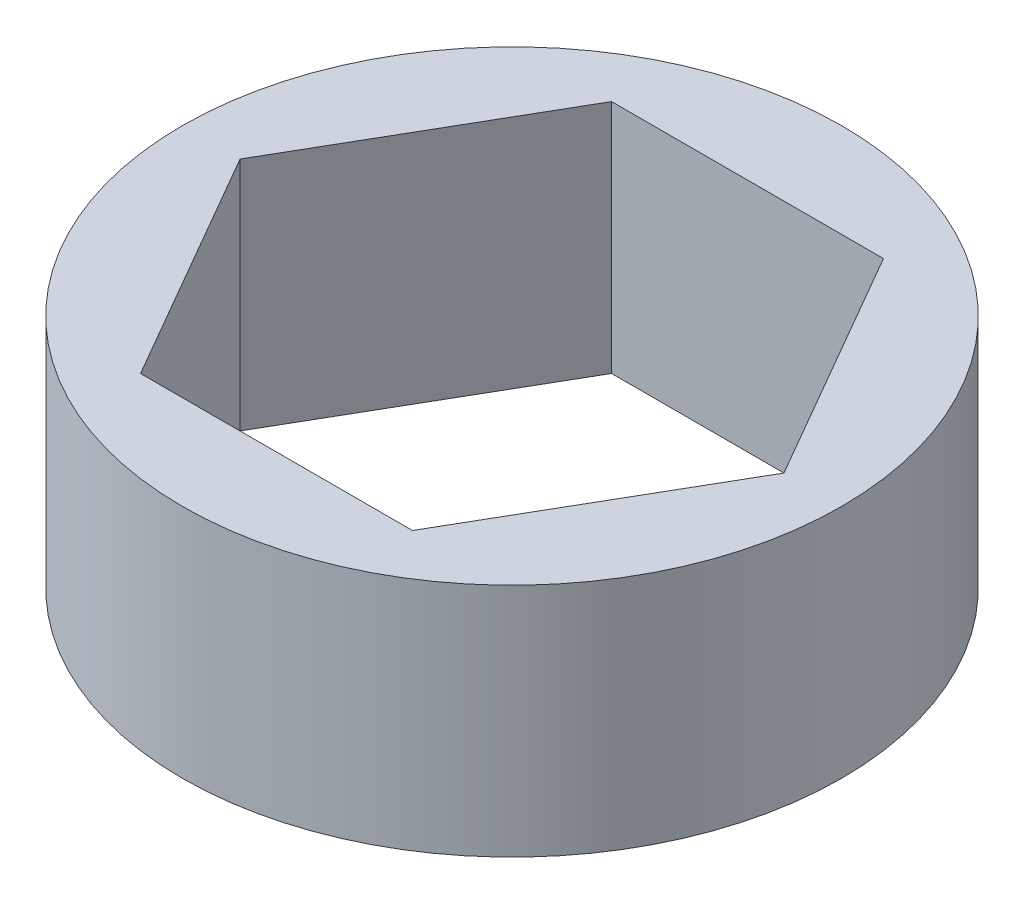
ISO-10303-21;
HEADER;
FILE_DESCRIPTION(('STEP AP214'),'2;1');
FILE_NAME('part.step','',(''),(''),'','','');
FILE_SCHEMA(('AUTOMOTIVE_DESIGN { 1 0 10303 214 1 1 1 1 }'));
ENDSEC;
DATA;
#1=APPLICATION_CONTEXT('core data for automotive mechanical design processes');
#2=APPLICATION_PROTOCOL_DEFINITION('international standard','automotive_design',2000,#1);
#3=PRODUCT_CONTEXT('',#1,'mechanical');
#4=PRODUCT('Part','Part','',(#3));
#5=PRODUCT_RELATED_PRODUCT_CATEGORY('part','',(#4));
#6=PRODUCT_DEFINITION_FORMATION('','',#4);
#7=PRODUCT_DEFINITION_CONTEXT('part definition',#1,'design');
#8=PRODUCT_DEFINITION('design','',#6,#7);
#9=PRODUCT_DEFINITION_SHAPE('','',#8);
#10=(LENGTH_UNIT() NAMED_UNIT(*) SI_UNIT(.MILLI.,.METRE.));
#11=(NAMED_UNIT(*) PLANE_ANGLE_UNIT() SI_UNIT($,.RADIAN.));
#12=(NAMED_UNIT(*) SI_UNIT($,.STERADIAN.) SOLID_ANGLE_UNIT());
#13=UNCERTAINTY_MEASURE_WITH_UNIT(LENGTH_MEASURE(1.E-05),#10,'distance_accuracy_value','');
#14=(GEOMETRIC_REPRESENTATION_CONTEXT(3) GLOBAL_UNCERTAINTY_ASSIGNED_CONTEXT((#13)) GLOBAL_UNIT_ASSIGNED_CONTEXT((#10,
#11,#12)) REPRESENTATION_CONTEXT('',''));
#15=CARTESIAN_POINT('',(0.,0.,0.));
#16=DIRECTION('',(0.,0.,1.));
#17=DIRECTION('',(1.,0.,0.));
#18=AXIS2_PLACEMENT_3D('',#15,#16,#17);
#19=CARTESIAN_POINT('',(0.,6.35,0.));
#20=DIRECTION('',(0.,1.,0.));
#21=DIRECTION('',(0.,0.,1.));
#22=AXIS2_PLACEMENT_3D('',#19,#20,#21);
#23=PLANE('',#22);
#24=CARTESIAN_POINT('',(0.,6.35,0.));
#25=DIRECTION('',(0.,1.,0.));
#26=DIRECTION('',(0.,0.,1.));
#27=AXIS2_PLACEMENT_3D('',#24,#25,#26);
#28=CIRCLE('',#27,8.89);
#29=CARTESIAN_POINT('',(0.,6.35,8.89));
#30=VERTEX_POINT('',#29);
#31=EDGE_CURVE('E11',#30,#30,#28,.T.);
#32=ORIENTED_EDGE('',*,*,#31,.T.);
#33=EDGE_LOOP('',(#32));
#34=FACE_BOUND('',#33,.T.);
#35=DIRECTION('',(-0.5,0.,-0.866025403784439));
#36=VECTOR('',#35,1.);
#37=CARTESIAN_POINT('',(7.33234841870825,6.35,0.));
#38=LINE('',#37,#36);
#39=CARTESIAN_POINT('',(7.33234841870825,6.35,0.));
#40=VERTEX_POINT('',#39);
#41=CARTESIAN_POINT('',(3.66617420935412,6.35,-6.35000000000001));
#42=VERTEX_POINT('',#41);
#43=EDGE_CURVE('E108',#40,#42,#38,.T.);
#44=ORIENTED_EDGE('',*,*,#43,.F.);
#45=DIRECTION('',(0.5,0.,-0.866025403784439));
#46=VECTOR('',#45,1.);
#47=CARTESIAN_POINT('',(3.66617420935413,6.35,6.35));
#48=LINE('',#47,#46);
#49=CARTESIAN_POINT('',(3.66617420935413,6.35,6.35));
#50=VERTEX_POINT('',#49);
#51=EDGE_CURVE('E99',#50,#40,#48,.T.);
#52=ORIENTED_EDGE('',*,*,#51,.F.);
#53=DIRECTION('',(1.,0.,0.));
#54=VECTOR('',#53,1.);
#55=CARTESIAN_POINT('',(-3.66617420935413,6.35,6.35));
#56=LINE('',#55,#54);
#57=CARTESIAN_POINT('',(-3.66617420935413,6.35,6.35));
#58=VERTEX_POINT('',#57);
#59=EDGE_CURVE('E133',#58,#50,#56,.T.);
#60=ORIENTED_EDGE('',*,*,#59,.F.);
#61=DIRECTION('',(0.5,0.,0.866025403784439));
#62=VECTOR('',#61,1.);
#63=CARTESIAN_POINT('',(-7.33234841870825,6.35,0.));
#64=LINE('',#63,#62);
#65=CARTESIAN_POINT('',(-7.33234841870825,6.35,0.));
#66=VERTEX_POINT('',#65);
#67=EDGE_CURVE('E130',#66,#58,#64,.T.);
#68=ORIENTED_EDGE('',*,*,#67,.F.);
#69=DIRECTION('',(-0.5,0.,0.866025403784439));
#70=VECTOR('',#69,1.);
#71=CARTESIAN_POINT('',(-3.66617420935413,6.35,-6.35000000000001));
#72=LINE('',#71,#70);
#73=CARTESIAN_POINT('',(-3.66617420935413,6.35,-6.35000000000001));
#74=VERTEX_POINT('',#73);
#75=EDGE_CURVE('E125',#74,#66,#72,.T.);
#76=ORIENTED_EDGE('',*,*,#75,.F.);
#77=DIRECTION('',(-1.,0.,0.));
#78=VECTOR('',#77,1.);
#79=CARTESIAN_POINT('',(3.66617420935412,6.35,-6.35000000000001));
#80=LINE('',#79,#78);
#81=EDGE_CURVE('E121',#42,#74,#80,.T.);
#82=ORIENTED_EDGE('',*,*,#81,.F.);
#83=EDGE_LOOP('',(#44,#52,#60,#68,#76,#82));
#84=FACE_BOUND('',#83,.T.);
#85=ADVANCED_FACE('F45',(#34,#84),#23,.T.);
#86=CARTESIAN_POINT('',(0.,0.,0.));
#87=DIRECTION('',(0.,1.,0.));
#88=DIRECTION('',(0.,0.,1.));
#89=AXIS2_PLACEMENT_3D('',#86,#87,#88);
#90=PLANE('',#89);
#91=CARTESIAN_POINT('',(0.,0.,0.));
#92=DIRECTION('',(0.,1.,0.));
#93=DIRECTION('',(0.,0.,1.));
#94=AXIS2_PLACEMENT_3D('',#91,#92,#93);
#95=CIRCLE('',#94,8.89);
#96=CARTESIAN_POINT('',(0.,0.,8.89));
#97=VERTEX_POINT('',#96);
#98=EDGE_CURVE('E49',#97,#97,#95,.T.);
#99=ORIENTED_EDGE('',*,*,#98,.F.);
#100=EDGE_LOOP('',(#99));
#101=FACE_BOUND('',#100,.T.);
#102=DIRECTION('',(0.5,0.,-0.866025403784439));
#103=VECTOR('',#102,1.);
#104=CARTESIAN_POINT('',(3.66617420935413,0.,6.35));
#105=LINE('',#104,#103);
#106=CARTESIAN_POINT('',(3.66617420935413,0.,6.35));
#107=VERTEX_POINT('',#106);
#108=CARTESIAN_POINT('',(7.33234841870825,0.,0.));
#109=VERTEX_POINT('',#108);
#110=EDGE_CURVE('E69',#107,#109,#105,.T.);
#111=ORIENTED_EDGE('',*,*,#110,.T.);
#112=DIRECTION('',(-0.5,0.,-0.866025403784439));
#113=VECTOR('',#112,1.);
#114=CARTESIAN_POINT('',(7.33234841870825,0.,0.));
#115=LINE('',#114,#113);
#116=CARTESIAN_POINT('',(3.66617420935412,0.,-6.35000000000001));
#117=VERTEX_POINT('',#116);
#118=EDGE_CURVE('E115',#109,#117,#115,.T.);
#119=ORIENTED_EDGE('',*,*,#118,.T.);
#120=DIRECTION('',(-1.,0.,0.));
#121=VECTOR('',#120,1.);
#122=CARTESIAN_POINT('',(3.66617420935412,0.,-6.35000000000001));
#123=LINE('',#122,#121);
#124=CARTESIAN_POINT('',(-3.66617420935413,0.,-6.35000000000001));
#125=VERTEX_POINT('',#124);
#126=EDGE_CURVE('E140',#117,#125,#123,.T.);
#127=ORIENTED_EDGE('',*,*,#126,.T.);
#128=DIRECTION('',(-0.5,0.,0.866025403784439));
#129=VECTOR('',#128,1.);
#130=CARTESIAN_POINT('',(-3.66617420935413,0.,-6.35000000000001));
#131=LINE('',#130,#129);
#132=CARTESIAN_POINT('',(-7.33234841870825,0.,0.));
#133=VERTEX_POINT('',#132);
#134=EDGE_CURVE('E144',#125,#133,#131,.T.);
#135=ORIENTED_EDGE('',*,*,#134,.T.);
#136=DIRECTION('',(0.5,0.,0.866025403784439));
#137=VECTOR('',#136,1.);
#138=CARTESIAN_POINT('',(-7.33234841870825,0.,0.));
#139=LINE('',#138,#137);
#140=CARTESIAN_POINT('',(-3.66617420935413,0.,6.35));
#141=VERTEX_POINT('',#140);
#142=EDGE_CURVE('E148',#133,#141,#139,.T.);
#143=ORIENTED_EDGE('',*,*,#142,.T.);
#144=DIRECTION('',(1.,0.,0.));
#145=VECTOR('',#144,1.);
#146=CARTESIAN_POINT('',(-3.66617420935413,0.,6.35));
#147=LINE('',#146,#145);
#148=EDGE_CURVE('E109',#141,#107,#147,.T.);
#149=ORIENTED_EDGE('',*,*,#148,.T.);
#150=EDGE_LOOP('',(#111,#119,#127,#135,#143,#149));
#151=FACE_BOUND('',#150,.T.);
#152=ADVANCED_FACE('F172',(#101,#151),#90,.F.);
#153=CARTESIAN_POINT('',(0.,6.35,0.));
#154=DIRECTION('',(0.,-1.,0.));
#155=DIRECTION('',(0.,0.,-1.));
#156=AXIS2_PLACEMENT_3D('',#153,#154,#155);
#157=CYLINDRICAL_SURFACE('',#156,8.89);
#158=ORIENTED_EDGE('',*,*,#31,.F.);
#159=EDGE_LOOP('',(#158));
#160=FACE_BOUND('',#159,.T.);
#161=ORIENTED_EDGE('',*,*,#98,.T.);
#162=EDGE_LOOP('',(#161));
#163=FACE_BOUND('',#162,.T.);
#164=ADVANCED_FACE('F47',(#160,#163),#157,.T.);
#165=CARTESIAN_POINT('',(3.66617420935413,6.35,6.35));
#166=DIRECTION('',(-0.866025403784439,0.,-0.5));
#167=DIRECTION('',(-0.5,0.,0.866025403784439));
#168=AXIS2_PLACEMENT_3D('',#165,#166,#167);
#169=PLANE('',#168);
#170=ORIENTED_EDGE('',*,*,#110,.F.);
#171=DIRECTION('',(0.,-1.,0.));
#172=VECTOR('',#171,1.);
#173=CARTESIAN_POINT('',(3.66617420935413,6.35,6.35));
#174=LINE('',#173,#172);
#175=EDGE_CURVE('E103',#50,#107,#174,.T.);
#176=ORIENTED_EDGE('',*,*,#175,.F.);
#177=ORIENTED_EDGE('',*,*,#51,.T.);
#178=DIRECTION('',(0.,-1.,0.));
#179=VECTOR('',#178,1.);
#180=CARTESIAN_POINT('',(7.33234841870825,6.35,0.));
#181=LINE('',#180,#179);
#182=EDGE_CURVE('E102',#40,#109,#181,.T.);
#183=ORIENTED_EDGE('',*,*,#182,.T.);
#184=EDGE_LOOP('',(#170,#176,#177,#183));
#185=FACE_BOUND('',#184,.T.);
#186=ADVANCED_FACE('F101',(#185),#169,.T.);
#187=CARTESIAN_POINT('',(7.33234841870825,6.35,0.));
#188=DIRECTION('',(-0.866025403784439,0.,0.5));
#189=DIRECTION('',(0.5,0.,0.866025403784439));
#190=AXIS2_PLACEMENT_3D('',#187,#188,#189);
#191=PLANE('',#190);
#192=ORIENTED_EDGE('',*,*,#118,.F.);
#193=ORIENTED_EDGE('',*,*,#182,.F.);
#194=ORIENTED_EDGE('',*,*,#43,.T.);
#195=DIRECTION('',(0.,-1.,0.));
#196=VECTOR('',#195,1.);
#197=CARTESIAN_POINT('',(3.66617420935412,6.35,-6.35000000000001));
#198=LINE('',#197,#196);
#199=EDGE_CURVE('E117',#42,#117,#198,.T.);
#200=ORIENTED_EDGE('',*,*,#199,.T.);
#201=EDGE_LOOP('',(#192,#193,#194,#200));
#202=FACE_BOUND('',#201,.T.);
#203=ADVANCED_FACE('F112',(#202),#191,.T.);
#204=CARTESIAN_POINT('',(3.66617420935412,6.35,-6.35000000000001));
#205=DIRECTION('',(0.,0.,1.));
#206=DIRECTION('',(1.,0.,0.));
#207=AXIS2_PLACEMENT_3D('',#204,#205,#206);
#208=PLANE('',#207);
#209=ORIENTED_EDGE('',*,*,#126,.F.);
#210=ORIENTED_EDGE('',*,*,#199,.F.);
#211=ORIENTED_EDGE('',*,*,#81,.T.);
#212=DIRECTION('',(0.,-1.,0.));
#213=VECTOR('',#212,1.);
#214=CARTESIAN_POINT('',(-3.66617420935413,6.35,-6.35000000000001));
#215=LINE('',#214,#213);
#216=EDGE_CURVE('E162',#74,#125,#215,.T.);
#217=ORIENTED_EDGE('',*,*,#216,.T.);
#218=EDGE_LOOP('',(#209,#210,#211,#217));
#219=FACE_BOUND('',#218,.T.);
#220=ADVANCED_FACE('F168',(#219),#208,.T.);
#221=CARTESIAN_POINT('',(-3.66617420935413,6.35,-6.35000000000001));
#222=DIRECTION('',(0.866025403784439,0.,0.5));
#223=DIRECTION('',(0.5,0.,-0.866025403784439));
#224=AXIS2_PLACEMENT_3D('',#221,#222,#223);
#225=PLANE('',#224);
#226=ORIENTED_EDGE('',*,*,#134,.F.);
#227=ORIENTED_EDGE('',*,*,#216,.F.);
#228=ORIENTED_EDGE('',*,*,#75,.T.);
#229=DIRECTION('',(0.,-1.,0.));
#230=VECTOR('',#229,1.);
#231=CARTESIAN_POINT('',(-7.33234841870825,6.35,0.));
#232=LINE('',#231,#230);
#233=EDGE_CURVE('E159',#66,#133,#232,.T.);
#234=ORIENTED_EDGE('',*,*,#233,.T.);
#235=EDGE_LOOP('',(#226,#227,#228,#234));
#236=FACE_BOUND('',#235,.T.);
#237=ADVANCED_FACE('F180',(#236),#225,.T.);
#238=CARTESIAN_POINT('',(-7.33234841870825,6.35,0.));
#239=DIRECTION('',(0.866025403784439,0.,-0.5));
#240=DIRECTION('',(-0.5,0.,-0.866025403784439));
#241=AXIS2_PLACEMENT_3D('',#238,#239,#240);
#242=PLANE('',#241);
#243=ORIENTED_EDGE('',*,*,#142,.F.);
#244=ORIENTED_EDGE('',*,*,#233,.F.);
#245=ORIENTED_EDGE('',*,*,#67,.T.);
#246=DIRECTION('',(0.,-1.,0.));
#247=VECTOR('',#246,1.);
#248=CARTESIAN_POINT('',(-3.66617420935413,6.35,6.35));
#249=LINE('',#248,#247);
#250=EDGE_CURVE('E61',#58,#141,#249,.T.);
#251=ORIENTED_EDGE('',*,*,#250,.T.);
#252=EDGE_LOOP('',(#243,#244,#245,#251));
#253=FACE_BOUND('',#252,.T.);
#254=ADVANCED_FACE('F178',(#253),#242,.T.);
#255=CARTESIAN_POINT('',(-3.66617420935413,6.35,6.35));
#256=DIRECTION('',(0.,0.,-1.));
#257=DIRECTION('',(-1.,0.,0.));
#258=AXIS2_PLACEMENT_3D('',#255,#256,#257);
#259=PLANE('',#258);
#260=ORIENTED_EDGE('',*,*,#148,.F.);
#261=ORIENTED_EDGE('',*,*,#250,.F.);
#262=ORIENTED_EDGE('',*,*,#59,.T.);
#263=ORIENTED_EDGE('',*,*,#175,.T.);
#264=EDGE_LOOP('',(#260,#261,#262,#263));
#265=FACE_BOUND('',#264,.T.);
#266=ADVANCED_FACE('F174',(#265),#259,.T.);
#267=CLOSED_SHELL('',(#85,#152,#164,#186,#203,#220,#237,#254,#266));
#268=MANIFOLD_SOLID_BREP('B2',#267);
#269=ADVANCED_BREP_SHAPE_REPRESENTATION('',(#18,#268),#14);
#270=SHAPE_DEFINITION_REPRESENTATION(#9,#269);
ENDSEC;
END-ISO-10303-21;
